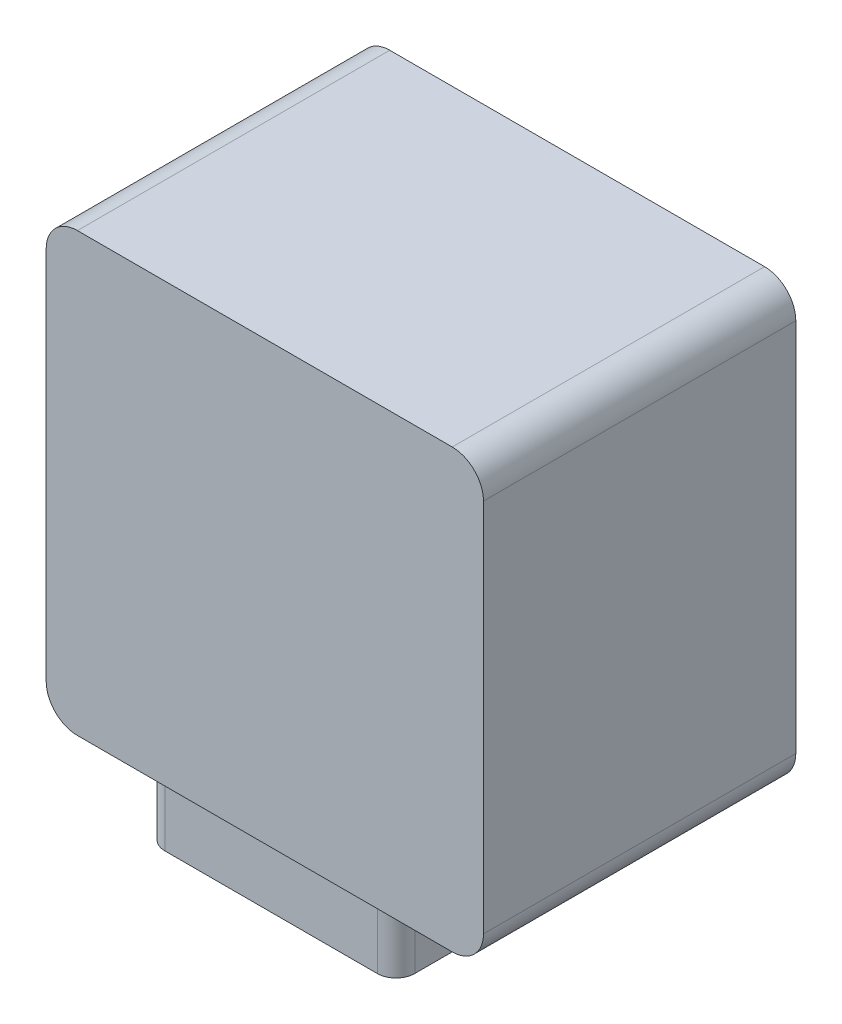
ISO-10303-21;
HEADER;
FILE_DESCRIPTION(('STEP AP214'),'2;1');
FILE_NAME('part.step','',(''),(''),'','','');
FILE_SCHEMA(('AUTOMOTIVE_DESIGN { 1 0 10303 214 1 1 1 1 }'));
ENDSEC;
DATA;
#1=APPLICATION_CONTEXT('core data for automotive mechanical design processes');
#2=APPLICATION_PROTOCOL_DEFINITION('international standard','automotive_design',2000,#1);
#3=PRODUCT_CONTEXT('',#1,'mechanical');
#4=PRODUCT('Part','Part','',(#3));
#5=PRODUCT_RELATED_PRODUCT_CATEGORY('part','',(#4));
#6=PRODUCT_DEFINITION_FORMATION('','',#4);
#7=PRODUCT_DEFINITION_CONTEXT('part definition',#1,'design');
#8=PRODUCT_DEFINITION('design','',#6,#7);
#9=PRODUCT_DEFINITION_SHAPE('','',#8);
#10=(LENGTH_UNIT() NAMED_UNIT(*) SI_UNIT(.MILLI.,.METRE.));
#11=(NAMED_UNIT(*) PLANE_ANGLE_UNIT() SI_UNIT($,.RADIAN.));
#12=(NAMED_UNIT(*) SI_UNIT($,.STERADIAN.) SOLID_ANGLE_UNIT());
#13=UNCERTAINTY_MEASURE_WITH_UNIT(LENGTH_MEASURE(1.E-05),#10,'distance_accuracy_value','');
#14=(GEOMETRIC_REPRESENTATION_CONTEXT(3) GLOBAL_UNCERTAINTY_ASSIGNED_CONTEXT((#13)) GLOBAL_UNIT_ASSIGNED_CONTEXT((#10,
#11,#12)) REPRESENTATION_CONTEXT('',''));
#15=CARTESIAN_POINT('',(0.,0.,0.));
#16=DIRECTION('',(0.,0.,1.));
#17=DIRECTION('',(1.,0.,0.));
#18=AXIS2_PLACEMENT_3D('',#15,#16,#17);
#19=CARTESIAN_POINT('',(11.8065425118772,61.2875658911726,50.));
#20=DIRECTION('',(0.,0.,-1.));
#21=DIRECTION('',(-1.,0.,0.));
#22=AXIS2_PLACEMENT_3D('',#19,#20,#21);
#23=CYLINDRICAL_SURFACE('',#22,5.);
#24=CARTESIAN_POINT('',(11.8065425118772,61.2875658911726,0.));
#25=DIRECTION('',(0.,0.,1.));
#26=DIRECTION('',(-1.,0.,0.));
#27=AXIS2_PLACEMENT_3D('',#24,#25,#26);
#28=CIRCLE('',#27,5.);
#29=CARTESIAN_POINT('',(16.8065425118772,61.2875658911726,0.));
#30=VERTEX_POINT('',#29);
#31=CARTESIAN_POINT('',(11.8065425118772,66.2875658911726,0.));
#32=VERTEX_POINT('',#31);
#33=EDGE_CURVE('E168',#30,#32,#28,.T.);
#34=ORIENTED_EDGE('',*,*,#33,.T.);
#35=DIRECTION('',(0.,0.,-1.));
#36=VECTOR('',#35,1.);
#37=CARTESIAN_POINT('',(11.8065425118772,66.2875658911726,50.));
#38=LINE('',#37,#36);
#39=CARTESIAN_POINT('',(11.8065425118772,66.2875658911726,50.));
#40=VERTEX_POINT('',#39);
#41=EDGE_CURVE('E11',#40,#32,#38,.T.);
#42=ORIENTED_EDGE('',*,*,#41,.F.);
#43=CARTESIAN_POINT('',(11.8065425118772,61.2875658911726,50.));
#44=DIRECTION('',(0.,0.,1.));
#45=DIRECTION('',(-1.,0.,0.));
#46=AXIS2_PLACEMENT_3D('',#43,#44,#45);
#47=CIRCLE('',#46,5.);
#48=CARTESIAN_POINT('',(16.8065425118772,61.2875658911726,50.));
#49=VERTEX_POINT('',#48);
#50=EDGE_CURVE('E177',#49,#40,#47,.T.);
#51=ORIENTED_EDGE('',*,*,#50,.F.);
#52=DIRECTION('',(0.,0.,-1.));
#53=VECTOR('',#52,1.);
#54=CARTESIAN_POINT('',(16.8065425118772,61.2875658911726,50.));
#55=LINE('',#54,#53);
#56=EDGE_CURVE('E194',#49,#30,#55,.T.);
#57=ORIENTED_EDGE('',*,*,#56,.T.);
#58=EDGE_LOOP('',(#34,#42,#51,#57));
#59=FACE_BOUND('',#58,.T.);
#60=ADVANCED_FACE('F34',(#59),#23,.T.);
#61=CARTESIAN_POINT('',(-48.1934574881227,66.2875658911726,50.));
#62=DIRECTION('',(0.,-1.,0.));
#63=DIRECTION('',(0.,0.,-1.));
#64=AXIS2_PLACEMENT_3D('',#61,#62,#63);
#65=PLANE('',#64);
#66=DIRECTION('',(-1.,0.,0.));
#67=VECTOR('',#66,1.);
#68=CARTESIAN_POINT('',(-48.1934574881227,66.2875658911726,0.));
#69=LINE('',#68,#67);
#70=CARTESIAN_POINT('',(-48.1934574881227,66.2875658911726,0.));
#71=VERTEX_POINT('',#70);
#72=EDGE_CURVE('E171',#32,#71,#69,.T.);
#73=ORIENTED_EDGE('',*,*,#72,.T.);
#74=DIRECTION('',(0.,0.,-1.));
#75=VECTOR('',#74,1.);
#76=CARTESIAN_POINT('',(-48.1934574881227,66.2875658911726,50.));
#77=LINE('',#76,#75);
#78=CARTESIAN_POINT('',(-48.1934574881227,66.2875658911726,50.));
#79=VERTEX_POINT('',#78);
#80=EDGE_CURVE('E41',#79,#71,#77,.T.);
#81=ORIENTED_EDGE('',*,*,#80,.F.);
#82=DIRECTION('',(-1.,0.,0.));
#83=VECTOR('',#82,1.);
#84=CARTESIAN_POINT('',(-48.1934574881227,66.2875658911726,50.));
#85=LINE('',#84,#83);
#86=EDGE_CURVE('E180',#40,#79,#85,.T.);
#87=ORIENTED_EDGE('',*,*,#86,.F.);
#88=ORIENTED_EDGE('',*,*,#41,.T.);
#89=EDGE_LOOP('',(#73,#81,#87,#88));
#90=FACE_BOUND('',#89,.T.);
#91=ADVANCED_FACE('F252',(#90),#65,.F.);
#92=CARTESIAN_POINT('',(-48.1934574881228,61.2875658911726,50.));
#93=DIRECTION('',(0.,0.,-1.));
#94=DIRECTION('',(-1.,0.,0.));
#95=AXIS2_PLACEMENT_3D('',#92,#93,#94);
#96=CYLINDRICAL_SURFACE('',#95,5.);
#97=CARTESIAN_POINT('',(-48.1934574881228,61.2875658911726,0.));
#98=DIRECTION('',(0.,0.,1.));
#99=DIRECTION('',(1.,0.,0.));
#100=AXIS2_PLACEMENT_3D('',#97,#98,#99);
#101=CIRCLE('',#100,5.);
#102=CARTESIAN_POINT('',(-53.1934574881228,61.2875658911726,0.));
#103=VERTEX_POINT('',#102);
#104=EDGE_CURVE('E197',#71,#103,#101,.T.);
#105=ORIENTED_EDGE('',*,*,#104,.T.);
#106=DIRECTION('',(0.,0.,-1.));
#107=VECTOR('',#106,1.);
#108=CARTESIAN_POINT('',(-53.1934574881228,61.2875658911726,50.));
#109=LINE('',#108,#107);
#110=CARTESIAN_POINT('',(-53.1934574881228,61.2875658911726,50.));
#111=VERTEX_POINT('',#110);
#112=EDGE_CURVE('E222',#111,#103,#109,.T.);
#113=ORIENTED_EDGE('',*,*,#112,.F.);
#114=CARTESIAN_POINT('',(-48.1934574881228,61.2875658911726,50.));
#115=DIRECTION('',(0.,0.,1.));
#116=DIRECTION('',(1.,0.,0.));
#117=AXIS2_PLACEMENT_3D('',#114,#115,#116);
#118=CIRCLE('',#117,5.);
#119=EDGE_CURVE('E183',#79,#111,#118,.T.);
#120=ORIENTED_EDGE('',*,*,#119,.F.);
#121=ORIENTED_EDGE('',*,*,#80,.T.);
#122=EDGE_LOOP('',(#105,#113,#120,#121));
#123=FACE_BOUND('',#122,.T.);
#124=ADVANCED_FACE('F229',(#123),#96,.T.);
#125=CARTESIAN_POINT('',(-53.1934574881228,61.2875658911726,50.));
#126=DIRECTION('',(1.,0.,0.));
#127=DIRECTION('',(0.,0.,-1.));
#128=AXIS2_PLACEMENT_3D('',#125,#126,#127);
#129=PLANE('',#128);
#130=DIRECTION('',(0.,-1.,0.));
#131=VECTOR('',#130,1.);
#132=CARTESIAN_POINT('',(-53.1934574881228,61.2875658911726,0.));
#133=LINE('',#132,#131);
#134=CARTESIAN_POINT('',(-53.1934574881228,1.28756589117266,0.));
#135=VERTEX_POINT('',#134);
#136=EDGE_CURVE('E199',#103,#135,#133,.T.);
#137=ORIENTED_EDGE('',*,*,#136,.T.);
#138=DIRECTION('',(0.,0.,-1.));
#139=VECTOR('',#138,1.);
#140=CARTESIAN_POINT('',(-53.1934574881228,1.28756589117266,50.));
#141=LINE('',#140,#139);
#142=CARTESIAN_POINT('',(-53.1934574881228,1.28756589117266,50.));
#143=VERTEX_POINT('',#142);
#144=EDGE_CURVE('E219',#143,#135,#141,.T.);
#145=ORIENTED_EDGE('',*,*,#144,.F.);
#146=DIRECTION('',(0.,-1.,0.));
#147=VECTOR('',#146,1.);
#148=CARTESIAN_POINT('',(-53.1934574881228,61.2875658911726,50.));
#149=LINE('',#148,#147);
#150=EDGE_CURVE('E185',#111,#143,#149,.T.);
#151=ORIENTED_EDGE('',*,*,#150,.F.);
#152=ORIENTED_EDGE('',*,*,#112,.T.);
#153=EDGE_LOOP('',(#137,#145,#151,#152));
#154=FACE_BOUND('',#153,.T.);
#155=ADVANCED_FACE('F240',(#154),#129,.F.);
#156=CARTESIAN_POINT('',(-48.1934574881228,1.28756589117263,50.));
#157=DIRECTION('',(0.,0.,-1.));
#158=DIRECTION('',(-1.,0.,0.));
#159=AXIS2_PLACEMENT_3D('',#156,#157,#158);
#160=CYLINDRICAL_SURFACE('',#159,5.);
#161=CARTESIAN_POINT('',(-48.1934574881228,1.28756589117263,0.));
#162=DIRECTION('',(0.,0.,1.));
#163=DIRECTION('',(1.,0.,0.));
#164=AXIS2_PLACEMENT_3D('',#161,#162,#163);
#165=CIRCLE('',#164,5.);
#166=CARTESIAN_POINT('',(-48.1934574881227,-3.71243410882737,0.));
#167=VERTEX_POINT('',#166);
#168=EDGE_CURVE('E201',#135,#167,#165,.T.);
#169=ORIENTED_EDGE('',*,*,#168,.T.);
#170=DIRECTION('',(0.,0.,-1.));
#171=VECTOR('',#170,1.);
#172=CARTESIAN_POINT('',(-48.1934574881227,-3.71243410882737,50.));
#173=LINE('',#172,#171);
#174=CARTESIAN_POINT('',(-48.1934574881227,-3.71243410882737,50.));
#175=VERTEX_POINT('',#174);
#176=EDGE_CURVE('E216',#175,#167,#173,.T.);
#177=ORIENTED_EDGE('',*,*,#176,.F.);
#178=CARTESIAN_POINT('',(-48.1934574881228,1.28756589117263,50.));
#179=DIRECTION('',(0.,0.,1.));
#180=DIRECTION('',(1.,0.,0.));
#181=AXIS2_PLACEMENT_3D('',#178,#179,#180);
#182=CIRCLE('',#181,5.);
#183=EDGE_CURVE('E187',#143,#175,#182,.T.);
#184=ORIENTED_EDGE('',*,*,#183,.F.);
#185=ORIENTED_EDGE('',*,*,#144,.T.);
#186=EDGE_LOOP('',(#169,#177,#184,#185));
#187=FACE_BOUND('',#186,.T.);
#188=ADVANCED_FACE('F244',(#187),#160,.T.);
#189=CARTESIAN_POINT('',(-48.1934574881227,-3.71243410882737,50.));
#190=DIRECTION('',(0.,1.,0.));
#191=DIRECTION('',(0.,0.,1.));
#192=AXIS2_PLACEMENT_3D('',#189,#190,#191);
#193=PLANE('',#192);
#194=CARTESIAN_POINT('',(-1.19345748812275,-3.71243410882737,12.));
#195=DIRECTION('',(0.,-1.,0.));
#196=DIRECTION('',(0.,0.,-1.));
#197=AXIS2_PLACEMENT_3D('',#194,#195,#196);
#198=CIRCLE('',#197,3.);
#199=CARTESIAN_POINT('',(-1.19345748812277,-3.71243410882737,9.));
#200=VERTEX_POINT('',#199);
#201=CARTESIAN_POINT('',(1.80654251187724,-3.71243410882737,12.));
#202=VERTEX_POINT('',#201);
#203=EDGE_CURVE('E510',#200,#202,#198,.T.);
#204=ORIENTED_EDGE('',*,*,#203,.F.);
#205=DIRECTION('',(1.,0.,0.));
#206=VECTOR('',#205,1.);
#207=CARTESIAN_POINT('',(-18.1934574881228,-3.71243410882737,9.));
#208=LINE('',#207,#206);
#209=CARTESIAN_POINT('',(-35.1934574881227,-3.71243410882737,9.));
#210=VERTEX_POINT('',#209);
#211=EDGE_CURVE('E164',#210,#200,#208,.T.);
#212=ORIENTED_EDGE('',*,*,#211,.F.);
#213=CARTESIAN_POINT('',(-35.1934574881227,-3.71243410882737,12.));
#214=DIRECTION('',(0.,-1.,0.));
#215=DIRECTION('',(0.,0.,1.));
#216=AXIS2_PLACEMENT_3D('',#213,#214,#215);
#217=CIRCLE('',#216,3.);
#218=CARTESIAN_POINT('',(-38.1934574881228,-3.71243410882737,12.));
#219=VERTEX_POINT('',#218);
#220=EDGE_CURVE('E536',#219,#210,#217,.T.);
#221=ORIENTED_EDGE('',*,*,#220,.F.);
#222=DIRECTION('',(0.,0.,-1.));
#223=VECTOR('',#222,1.);
#224=CARTESIAN_POINT('',(-38.1934574881228,-3.71243410882737,12.));
#225=LINE('',#224,#223);
#226=CARTESIAN_POINT('',(-38.1934574881228,-3.71243410882737,46.));
#227=VERTEX_POINT('',#226);
#228=EDGE_CURVE('E533',#227,#219,#225,.T.);
#229=ORIENTED_EDGE('',*,*,#228,.F.);
#230=CARTESIAN_POINT('',(-35.1934574881227,-3.71243410882737,46.));
#231=DIRECTION('',(0.,-1.,0.));
#232=DIRECTION('',(0.,0.,1.));
#233=AXIS2_PLACEMENT_3D('',#230,#231,#232);
#234=CIRCLE('',#233,3.);
#235=CARTESIAN_POINT('',(-35.1934574881227,-3.71243410882737,49.));
#236=VERTEX_POINT('',#235);
#237=EDGE_CURVE('E530',#236,#227,#234,.T.);
#238=ORIENTED_EDGE('',*,*,#237,.F.);
#239=DIRECTION('',(-1.,0.,0.));
#240=VECTOR('',#239,1.);
#241=CARTESIAN_POINT('',(-35.1934574881227,-3.71243410882737,49.));
#242=LINE('',#241,#240);
#243=CARTESIAN_POINT('',(-1.19345748812277,-3.71243410882737,49.));
#244=VERTEX_POINT('',#243);
#245=EDGE_CURVE('E527',#244,#236,#242,.T.);
#246=ORIENTED_EDGE('',*,*,#245,.F.);
#247=CARTESIAN_POINT('',(-1.19345748812275,-3.71243410882737,46.));
#248=DIRECTION('',(0.,-1.,0.));
#249=DIRECTION('',(0.,0.,1.));
#250=AXIS2_PLACEMENT_3D('',#247,#248,#249);
#251=CIRCLE('',#250,3.);
#252=CARTESIAN_POINT('',(1.80654251187725,-3.71243410882737,46.));
#253=VERTEX_POINT('',#252);
#254=EDGE_CURVE('E53',#253,#244,#251,.T.);
#255=ORIENTED_EDGE('',*,*,#254,.F.);
#256=DIRECTION('',(0.,0.,1.));
#257=VECTOR('',#256,1.);
#258=CARTESIAN_POINT('',(1.80654251187725,-3.71243410882737,46.));
#259=LINE('',#258,#257);
#260=EDGE_CURVE('E48',#202,#253,#259,.T.);
#261=ORIENTED_EDGE('',*,*,#260,.F.);
#262=EDGE_LOOP('',(#204,#212,#221,#229,#238,#246,#255,#261));
#263=FACE_BOUND('',#262,.T.);
#264=DIRECTION('',(1.,0.,0.));
#265=VECTOR('',#264,1.);
#266=CARTESIAN_POINT('',(-48.1934574881227,-3.71243410882737,0.));
#267=LINE('',#266,#265);
#268=CARTESIAN_POINT('',(11.8065425118772,-3.71243410882737,0.));
#269=VERTEX_POINT('',#268);
#270=EDGE_CURVE('E203',#167,#269,#267,.T.);
#271=ORIENTED_EDGE('',*,*,#270,.T.);
#272=DIRECTION('',(0.,0.,-1.));
#273=VECTOR('',#272,1.);
#274=CARTESIAN_POINT('',(11.8065425118772,-3.71243410882737,50.));
#275=LINE('',#274,#273);
#276=CARTESIAN_POINT('',(11.8065425118772,-3.71243410882737,50.));
#277=VERTEX_POINT('',#276);
#278=EDGE_CURVE('E213',#277,#269,#275,.T.);
#279=ORIENTED_EDGE('',*,*,#278,.F.);
#280=DIRECTION('',(1.,0.,0.));
#281=VECTOR('',#280,1.);
#282=CARTESIAN_POINT('',(-48.1934574881227,-3.71243410882737,50.));
#283=LINE('',#282,#281);
#284=EDGE_CURVE('E189',#175,#277,#283,.T.);
#285=ORIENTED_EDGE('',*,*,#284,.F.);
#286=ORIENTED_EDGE('',*,*,#176,.T.);
#287=EDGE_LOOP('',(#271,#279,#285,#286));
#288=FACE_BOUND('',#287,.T.);
#289=ADVANCED_FACE('F265',(#263,#288),#193,.F.);
#290=CARTESIAN_POINT('',(11.8065425118773,1.28756589117263,50.));
#291=DIRECTION('',(0.,0.,-1.));
#292=DIRECTION('',(-1.,0.,0.));
#293=AXIS2_PLACEMENT_3D('',#290,#291,#292);
#294=CYLINDRICAL_SURFACE('',#293,5.);
#295=CARTESIAN_POINT('',(11.8065425118773,1.28756589117263,0.));
#296=DIRECTION('',(0.,0.,1.));
#297=DIRECTION('',(1.,0.,0.));
#298=AXIS2_PLACEMENT_3D('',#295,#296,#297);
#299=CIRCLE('',#298,5.);
#300=CARTESIAN_POINT('',(16.8065425118773,1.28756589117263,0.));
#301=VERTEX_POINT('',#300);
#302=EDGE_CURVE('E205',#269,#301,#299,.T.);
#303=ORIENTED_EDGE('',*,*,#302,.T.);
#304=DIRECTION('',(0.,0.,-1.));
#305=VECTOR('',#304,1.);
#306=CARTESIAN_POINT('',(16.8065425118773,1.28756589117263,50.));
#307=LINE('',#306,#305);
#308=CARTESIAN_POINT('',(16.8065425118773,1.28756589117263,50.));
#309=VERTEX_POINT('',#308);
#310=EDGE_CURVE('E210',#309,#301,#307,.T.);
#311=ORIENTED_EDGE('',*,*,#310,.F.);
#312=CARTESIAN_POINT('',(11.8065425118773,1.28756589117263,50.));
#313=DIRECTION('',(0.,0.,1.));
#314=DIRECTION('',(1.,0.,0.));
#315=AXIS2_PLACEMENT_3D('',#312,#313,#314);
#316=CIRCLE('',#315,5.);
#317=EDGE_CURVE('E191',#277,#309,#316,.T.);
#318=ORIENTED_EDGE('',*,*,#317,.F.);
#319=ORIENTED_EDGE('',*,*,#278,.T.);
#320=EDGE_LOOP('',(#303,#311,#318,#319));
#321=FACE_BOUND('',#320,.T.);
#322=ADVANCED_FACE('F263',(#321),#294,.T.);
#323=CARTESIAN_POINT('',(16.8065425118772,61.2875658911726,50.));
#324=DIRECTION('',(-1.,0.,0.));
#325=DIRECTION('',(0.,-1.,0.));
#326=AXIS2_PLACEMENT_3D('',#323,#324,#325);
#327=PLANE('',#326);
#328=DIRECTION('',(0.,1.,0.));
#329=VECTOR('',#328,1.);
#330=CARTESIAN_POINT('',(16.8065425118772,61.2875658911726,0.));
#331=LINE('',#330,#329);
#332=EDGE_CURVE('E181',#301,#30,#331,.T.);
#333=ORIENTED_EDGE('',*,*,#332,.T.);
#334=ORIENTED_EDGE('',*,*,#56,.F.);
#335=DIRECTION('',(0.,1.,0.));
#336=VECTOR('',#335,1.);
#337=CARTESIAN_POINT('',(16.8065425118772,61.2875658911726,50.));
#338=LINE('',#337,#336);
#339=EDGE_CURVE('E193',#309,#49,#338,.T.);
#340=ORIENTED_EDGE('',*,*,#339,.F.);
#341=ORIENTED_EDGE('',*,*,#310,.T.);
#342=EDGE_LOOP('',(#333,#334,#340,#341));
#343=FACE_BOUND('',#342,.T.);
#344=ADVANCED_FACE('F258',(#343),#327,.F.);
#345=CARTESIAN_POINT('',(11.8065425118772,61.2875658911726,50.));
#346=DIRECTION('',(0.,0.,-1.));
#347=DIRECTION('',(-1.,0.,0.));
#348=AXIS2_PLACEMENT_3D('',#345,#346,#347);
#349=PLANE('',#348);
#350=ORIENTED_EDGE('',*,*,#50,.T.);
#351=ORIENTED_EDGE('',*,*,#86,.T.);
#352=ORIENTED_EDGE('',*,*,#119,.T.);
#353=ORIENTED_EDGE('',*,*,#150,.T.);
#354=ORIENTED_EDGE('',*,*,#183,.T.);
#355=ORIENTED_EDGE('',*,*,#284,.T.);
#356=ORIENTED_EDGE('',*,*,#317,.T.);
#357=ORIENTED_EDGE('',*,*,#339,.T.);
#358=EDGE_LOOP('',(#350,#351,#352,#353,#354,#355,#356,#357));
#359=FACE_BOUND('',#358,.T.);
#360=ADVANCED_FACE('F248',(#359),#349,.F.);
#361=CARTESIAN_POINT('',(11.8065425118772,61.2875658911726,0.));
#362=DIRECTION('',(0.,0.,-1.));
#363=DIRECTION('',(-1.,0.,0.));
#364=AXIS2_PLACEMENT_3D('',#361,#362,#363);
#365=PLANE('',#364);
#366=ORIENTED_EDGE('',*,*,#33,.F.);
#367=ORIENTED_EDGE('',*,*,#332,.F.);
#368=ORIENTED_EDGE('',*,*,#302,.F.);
#369=ORIENTED_EDGE('',*,*,#270,.F.);
#370=ORIENTED_EDGE('',*,*,#168,.F.);
#371=ORIENTED_EDGE('',*,*,#136,.F.);
#372=ORIENTED_EDGE('',*,*,#104,.F.);
#373=ORIENTED_EDGE('',*,*,#72,.F.);
#374=EDGE_LOOP('',(#366,#367,#368,#369,#370,#371,#372,#373));
#375=FACE_BOUND('',#374,.T.);
#376=ADVANCED_FACE('F235',(#375),#365,.T.);
#377=CARTESIAN_POINT('',(-1.19345748812275,-13.7124341088274,12.));
#378=DIRECTION('',(0.,-1.,0.));
#379=DIRECTION('',(0.,0.,-1.));
#380=AXIS2_PLACEMENT_3D('',#377,#378,#379);
#381=PLANE('',#380);
#382=CARTESIAN_POINT('',(-18.1934574881227,-13.7124341088274,16.5));
#383=DIRECTION('',(0.,-1.,0.));
#384=DIRECTION('',(0.,0.,-1.));
#385=AXIS2_PLACEMENT_3D('',#382,#383,#384);
#386=CIRCLE('',#385,3.);
#387=CARTESIAN_POINT('',(-18.1934574881227,-13.7124341088274,13.5));
#388=VERTEX_POINT('',#387);
#389=EDGE_CURVE('E497',#388,#388,#386,.T.);
#390=ORIENTED_EDGE('',*,*,#389,.F.);
#391=EDGE_LOOP('',(#390));
#392=FACE_BOUND('',#391,.T.);
#393=CARTESIAN_POINT('',(-18.1934574881227,-13.7124341088274,41.5));
#394=DIRECTION('',(0.,-1.,0.));
#395=DIRECTION('',(0.,0.,-1.));
#396=AXIS2_PLACEMENT_3D('',#393,#394,#395);
#397=CIRCLE('',#396,3.);
#398=CARTESIAN_POINT('',(-18.1934574881227,-13.7124341088274,38.5));
#399=VERTEX_POINT('',#398);
#400=EDGE_CURVE('E507',#399,#399,#397,.T.);
#401=ORIENTED_EDGE('',*,*,#400,.F.);
#402=EDGE_LOOP('',(#401));
#403=FACE_BOUND('',#402,.T.);
#404=DIRECTION('',(1.,0.,0.));
#405=VECTOR('',#404,1.);
#406=CARTESIAN_POINT('',(-18.1934574881228,-13.7124341088274,9.));
#407=LINE('',#406,#405);
#408=CARTESIAN_POINT('',(-35.1934574881227,-13.7124341088274,9.));
#409=VERTEX_POINT('',#408);
#410=CARTESIAN_POINT('',(-1.19345748812277,-13.7124341088274,9.));
#411=VERTEX_POINT('',#410);
#412=EDGE_CURVE('E154',#409,#411,#407,.T.);
#413=ORIENTED_EDGE('',*,*,#412,.T.);
#414=CARTESIAN_POINT('',(-1.19345748812275,-13.7124341088274,12.));
#415=DIRECTION('',(0.,-1.,0.));
#416=DIRECTION('',(0.,0.,-1.));
#417=AXIS2_PLACEMENT_3D('',#414,#415,#416);
#418=CIRCLE('',#417,3.);
#419=CARTESIAN_POINT('',(1.80654251187725,-13.7124341088274,12.));
#420=VERTEX_POINT('',#419);
#421=EDGE_CURVE('E144',#411,#420,#418,.T.);
#422=ORIENTED_EDGE('',*,*,#421,.T.);
#423=DIRECTION('',(0.,0.,1.));
#424=VECTOR('',#423,1.);
#425=CARTESIAN_POINT('',(1.80654251187725,-13.7124341088274,46.));
#426=LINE('',#425,#424);
#427=CARTESIAN_POINT('',(1.80654251187725,-13.7124341088274,46.));
#428=VERTEX_POINT('',#427);
#429=EDGE_CURVE('E153',#420,#428,#426,.T.);
#430=ORIENTED_EDGE('',*,*,#429,.T.);
#431=CARTESIAN_POINT('',(-1.19345748812275,-13.7124341088274,46.));
#432=DIRECTION('',(0.,-1.,0.));
#433=DIRECTION('',(0.,0.,1.));
#434=AXIS2_PLACEMENT_3D('',#431,#432,#433);
#435=CIRCLE('',#434,3.);
#436=CARTESIAN_POINT('',(-1.19345748812277,-13.7124341088274,49.));
#437=VERTEX_POINT('',#436);
#438=EDGE_CURVE('E514',#428,#437,#435,.T.);
#439=ORIENTED_EDGE('',*,*,#438,.T.);
#440=DIRECTION('',(-1.,0.,0.));
#441=VECTOR('',#440,1.);
#442=CARTESIAN_POINT('',(-35.1934574881227,-13.7124341088274,49.));
#443=LINE('',#442,#441);
#444=CARTESIAN_POINT('',(-35.1934574881227,-13.7124341088274,49.));
#445=VERTEX_POINT('',#444);
#446=EDGE_CURVE('E516',#437,#445,#443,.T.);
#447=ORIENTED_EDGE('',*,*,#446,.T.);
#448=CARTESIAN_POINT('',(-35.1934574881227,-13.7124341088274,46.));
#449=DIRECTION('',(0.,-1.,0.));
#450=DIRECTION('',(0.,0.,1.));
#451=AXIS2_PLACEMENT_3D('',#448,#449,#450);
#452=CIRCLE('',#451,3.);
#453=CARTESIAN_POINT('',(-38.1934574881228,-13.7124341088274,46.));
#454=VERTEX_POINT('',#453);
#455=EDGE_CURVE('E518',#445,#454,#452,.T.);
#456=ORIENTED_EDGE('',*,*,#455,.T.);
#457=DIRECTION('',(0.,0.,-1.));
#458=VECTOR('',#457,1.);
#459=CARTESIAN_POINT('',(-38.1934574881228,-13.7124341088274,12.));
#460=LINE('',#459,#458);
#461=CARTESIAN_POINT('',(-38.1934574881228,-13.7124341088274,12.));
#462=VERTEX_POINT('',#461);
#463=EDGE_CURVE('E520',#454,#462,#460,.T.);
#464=ORIENTED_EDGE('',*,*,#463,.T.);
#465=CARTESIAN_POINT('',(-35.1934574881227,-13.7124341088274,12.));
#466=DIRECTION('',(0.,-1.,0.));
#467=DIRECTION('',(0.,0.,1.));
#468=AXIS2_PLACEMENT_3D('',#465,#466,#467);
#469=CIRCLE('',#468,3.);
#470=EDGE_CURVE('E160',#462,#409,#469,.T.);
#471=ORIENTED_EDGE('',*,*,#470,.T.);
#472=EDGE_LOOP('',(#413,#422,#430,#439,#447,#456,#464,#471));
#473=FACE_BOUND('',#472,.T.);
#474=CARTESIAN_POINT('',(-30.6934574881227,-13.7124341088274,29.));
#475=DIRECTION('',(0.,-1.,0.));
#476=DIRECTION('',(0.,0.,-1.));
#477=AXIS2_PLACEMENT_3D('',#474,#475,#476);
#478=CIRCLE('',#477,3.);
#479=CARTESIAN_POINT('',(-30.6934574881227,-13.7124341088274,26.));
#480=VERTEX_POINT('',#479);
#481=EDGE_CURVE('E496',#480,#480,#478,.T.);
#482=ORIENTED_EDGE('',*,*,#481,.F.);
#483=EDGE_LOOP('',(#482));
#484=FACE_BOUND('',#483,.T.);
#485=CARTESIAN_POINT('',(-5.69345748812275,-13.7124341088274,29.));
#486=DIRECTION('',(0.,-1.,0.));
#487=DIRECTION('',(0.,0.,-1.));
#488=AXIS2_PLACEMENT_3D('',#485,#486,#487);
#489=CIRCLE('',#488,3.);
#490=CARTESIAN_POINT('',(-5.69345748812275,-13.7124341088274,26.));
#491=VERTEX_POINT('',#490);
#492=EDGE_CURVE('E567',#491,#491,#489,.T.);
#493=ORIENTED_EDGE('',*,*,#492,.F.);
#494=EDGE_LOOP('',(#493));
#495=FACE_BOUND('',#494,.T.);
#496=ADVANCED_FACE('F157',(#392,#403,#473,#484,#495),#381,.T.);
#497=CARTESIAN_POINT('',(-1.19345748812275,-13.7124341088274,12.));
#498=DIRECTION('',(0.,1.,0.));
#499=DIRECTION('',(0.,0.,1.));
#500=AXIS2_PLACEMENT_3D('',#497,#498,#499);
#501=CYLINDRICAL_SURFACE('',#500,3.);
#502=ORIENTED_EDGE('',*,*,#203,.T.);
#503=DIRECTION('',(0.,1.,0.));
#504=VECTOR('',#503,1.);
#505=CARTESIAN_POINT('',(1.80654251187725,-13.7124341088274,12.));
#506=LINE('',#505,#504);
#507=EDGE_CURVE('E150',#420,#202,#506,.T.);
#508=ORIENTED_EDGE('',*,*,#507,.F.);
#509=ORIENTED_EDGE('',*,*,#421,.F.);
#510=DIRECTION('',(0.,1.,0.));
#511=VECTOR('',#510,1.);
#512=CARTESIAN_POINT('',(-1.19345748812277,-13.7124341088274,9.));
#513=LINE('',#512,#511);
#514=EDGE_CURVE('E148',#411,#200,#513,.T.);
#515=ORIENTED_EDGE('',*,*,#514,.T.);
#516=EDGE_LOOP('',(#502,#508,#509,#515));
#517=FACE_BOUND('',#516,.T.);
#518=ADVANCED_FACE('F146',(#517),#501,.T.);
#519=CARTESIAN_POINT('',(1.80654251187725,-13.7124341088274,46.));
#520=DIRECTION('',(-1.,0.,0.));
#521=DIRECTION('',(0.,0.,1.));
#522=AXIS2_PLACEMENT_3D('',#519,#520,#521);
#523=PLANE('',#522);
#524=ORIENTED_EDGE('',*,*,#260,.T.);
#525=DIRECTION('',(0.,1.,0.));
#526=VECTOR('',#525,1.);
#527=CARTESIAN_POINT('',(1.80654251187725,-13.7124341088274,46.));
#528=LINE('',#527,#526);
#529=EDGE_CURVE('E173',#428,#253,#528,.T.);
#530=ORIENTED_EDGE('',*,*,#529,.F.);
#531=ORIENTED_EDGE('',*,*,#429,.F.);
#532=ORIENTED_EDGE('',*,*,#507,.T.);
#533=EDGE_LOOP('',(#524,#530,#531,#532));
#534=FACE_BOUND('',#533,.T.);
#535=ADVANCED_FACE('F354',(#534),#523,.F.);
#536=CARTESIAN_POINT('',(-1.19345748812275,-13.7124341088274,46.));
#537=DIRECTION('',(0.,1.,0.));
#538=DIRECTION('',(0.,0.,1.));
#539=AXIS2_PLACEMENT_3D('',#536,#537,#538);
#540=CYLINDRICAL_SURFACE('',#539,3.);
#541=ORIENTED_EDGE('',*,*,#254,.T.);
#542=DIRECTION('',(0.,1.,0.));
#543=VECTOR('',#542,1.);
#544=CARTESIAN_POINT('',(-1.19345748812277,-13.7124341088274,49.));
#545=LINE('',#544,#543);
#546=EDGE_CURVE('E550',#437,#244,#545,.T.);
#547=ORIENTED_EDGE('',*,*,#546,.F.);
#548=ORIENTED_EDGE('',*,*,#438,.F.);
#549=ORIENTED_EDGE('',*,*,#529,.T.);
#550=EDGE_LOOP('',(#541,#547,#548,#549));
#551=FACE_BOUND('',#550,.T.);
#552=ADVANCED_FACE('F363',(#551),#540,.T.);
#553=CARTESIAN_POINT('',(-35.1934574881227,-13.7124341088274,49.));
#554=DIRECTION('',(0.,0.,-1.));
#555=DIRECTION('',(-1.,0.,0.));
#556=AXIS2_PLACEMENT_3D('',#553,#554,#555);
#557=PLANE('',#556);
#558=ORIENTED_EDGE('',*,*,#245,.T.);
#559=DIRECTION('',(0.,1.,0.));
#560=VECTOR('',#559,1.);
#561=CARTESIAN_POINT('',(-35.1934574881227,-13.7124341088274,49.));
#562=LINE('',#561,#560);
#563=EDGE_CURVE('E547',#445,#236,#562,.T.);
#564=ORIENTED_EDGE('',*,*,#563,.F.);
#565=ORIENTED_EDGE('',*,*,#446,.F.);
#566=ORIENTED_EDGE('',*,*,#546,.T.);
#567=EDGE_LOOP('',(#558,#564,#565,#566));
#568=FACE_BOUND('',#567,.T.);
#569=ADVANCED_FACE('F373',(#568),#557,.F.);
#570=CARTESIAN_POINT('',(-35.1934574881227,-13.7124341088274,46.));
#571=DIRECTION('',(0.,1.,0.));
#572=DIRECTION('',(0.,0.,1.));
#573=AXIS2_PLACEMENT_3D('',#570,#571,#572);
#574=CYLINDRICAL_SURFACE('',#573,3.);
#575=ORIENTED_EDGE('',*,*,#237,.T.);
#576=DIRECTION('',(0.,1.,0.));
#577=VECTOR('',#576,1.);
#578=CARTESIAN_POINT('',(-38.1934574881228,-13.7124341088274,46.));
#579=LINE('',#578,#577);
#580=EDGE_CURVE('E544',#454,#227,#579,.T.);
#581=ORIENTED_EDGE('',*,*,#580,.F.);
#582=ORIENTED_EDGE('',*,*,#455,.F.);
#583=ORIENTED_EDGE('',*,*,#563,.T.);
#584=EDGE_LOOP('',(#575,#581,#582,#583));
#585=FACE_BOUND('',#584,.T.);
#586=ADVANCED_FACE('F383',(#585),#574,.T.);
#587=CARTESIAN_POINT('',(-38.1934574881228,-13.7124341088274,12.));
#588=DIRECTION('',(1.,0.,0.));
#589=DIRECTION('',(0.,0.,-1.));
#590=AXIS2_PLACEMENT_3D('',#587,#588,#589);
#591=PLANE('',#590);
#592=ORIENTED_EDGE('',*,*,#228,.T.);
#593=DIRECTION('',(0.,1.,0.));
#594=VECTOR('',#593,1.);
#595=CARTESIAN_POINT('',(-38.1934574881228,-13.7124341088274,12.));
#596=LINE('',#595,#594);
#597=EDGE_CURVE('E541',#462,#219,#596,.T.);
#598=ORIENTED_EDGE('',*,*,#597,.F.);
#599=ORIENTED_EDGE('',*,*,#463,.F.);
#600=ORIENTED_EDGE('',*,*,#580,.T.);
#601=EDGE_LOOP('',(#592,#598,#599,#600));
#602=FACE_BOUND('',#601,.T.);
#603=ADVANCED_FACE('F393',(#602),#591,.F.);
#604=CARTESIAN_POINT('',(-35.1934574881227,-13.7124341088274,12.));
#605=DIRECTION('',(0.,1.,0.));
#606=DIRECTION('',(0.,0.,1.));
#607=AXIS2_PLACEMENT_3D('',#604,#605,#606);
#608=CYLINDRICAL_SURFACE('',#607,3.);
#609=ORIENTED_EDGE('',*,*,#220,.T.);
#610=DIRECTION('',(0.,1.,0.));
#611=VECTOR('',#610,1.);
#612=CARTESIAN_POINT('',(-35.1934574881227,-13.7124341088274,9.));
#613=LINE('',#612,#611);
#614=EDGE_CURVE('E523',#409,#210,#613,.T.);
#615=ORIENTED_EDGE('',*,*,#614,.F.);
#616=ORIENTED_EDGE('',*,*,#470,.F.);
#617=ORIENTED_EDGE('',*,*,#597,.T.);
#618=EDGE_LOOP('',(#609,#615,#616,#617));
#619=FACE_BOUND('',#618,.T.);
#620=ADVANCED_FACE('F403',(#619),#608,.T.);
#621=CARTESIAN_POINT('',(-18.1934574881228,-13.7124341088274,9.));
#622=DIRECTION('',(0.,0.,1.));
#623=DIRECTION('',(1.,0.,0.));
#624=AXIS2_PLACEMENT_3D('',#621,#622,#623);
#625=PLANE('',#624);
#626=ORIENTED_EDGE('',*,*,#211,.T.);
#627=ORIENTED_EDGE('',*,*,#514,.F.);
#628=ORIENTED_EDGE('',*,*,#412,.F.);
#629=ORIENTED_EDGE('',*,*,#614,.T.);
#630=EDGE_LOOP('',(#626,#627,#628,#629));
#631=FACE_BOUND('',#630,.T.);
#632=ADVANCED_FACE('F167',(#631),#625,.F.);
#633=CARTESIAN_POINT('',(-18.1934574881227,-13.7124341088274,41.5));
#634=DIRECTION('',(0.,1.,0.));
#635=DIRECTION('',(0.,0.,1.));
#636=AXIS2_PLACEMENT_3D('',#633,#634,#635);
#637=CYLINDRICAL_SURFACE('',#636,3.);
#638=ORIENTED_EDGE('',*,*,#400,.T.);
#639=EDGE_LOOP('',(#638));
#640=FACE_BOUND('',#639,.T.);
#641=CARTESIAN_POINT('',(-18.1934574881227,-3.71243410882737,41.5));
#642=DIRECTION('',(0.,-1.,0.));
#643=DIRECTION('',(0.,0.,-1.));
#644=AXIS2_PLACEMENT_3D('',#641,#642,#643);
#645=CIRCLE('',#644,3.);
#646=CARTESIAN_POINT('',(-18.1934574881227,-3.71243410882737,38.5));
#647=VERTEX_POINT('',#646);
#648=EDGE_CURVE('E500',#647,#647,#645,.T.);
#649=ORIENTED_EDGE('',*,*,#648,.F.);
#650=EDGE_LOOP('',(#649));
#651=FACE_BOUND('',#650,.T.);
#652=ADVANCED_FACE('F423',(#640,#651),#637,.F.);
#653=CARTESIAN_POINT('',(-30.6934574881227,-13.7124341088274,29.));
#654=DIRECTION('',(0.,1.,0.));
#655=DIRECTION('',(0.,0.,1.));
#656=AXIS2_PLACEMENT_3D('',#653,#654,#655);
#657=CYLINDRICAL_SURFACE('',#656,3.);
#658=ORIENTED_EDGE('',*,*,#481,.T.);
#659=EDGE_LOOP('',(#658));
#660=FACE_BOUND('',#659,.T.);
#661=CARTESIAN_POINT('',(-30.6934574881227,-3.71243410882737,29.));
#662=DIRECTION('',(0.,-1.,0.));
#663=DIRECTION('',(0.,0.,-1.));
#664=AXIS2_PLACEMENT_3D('',#661,#662,#663);
#665=CIRCLE('',#664,3.);
#666=CARTESIAN_POINT('',(-30.6934574881227,-3.71243410882737,26.));
#667=VERTEX_POINT('',#666);
#668=EDGE_CURVE('E494',#667,#667,#665,.T.);
#669=ORIENTED_EDGE('',*,*,#668,.F.);
#670=EDGE_LOOP('',(#669));
#671=FACE_BOUND('',#670,.T.);
#672=ADVANCED_FACE('F432',(#660,#671),#657,.F.);
#673=CARTESIAN_POINT('',(-18.1934574881227,-13.7124341088274,16.5));
#674=DIRECTION('',(0.,1.,0.));
#675=DIRECTION('',(0.,0.,1.));
#676=AXIS2_PLACEMENT_3D('',#673,#674,#675);
#677=CYLINDRICAL_SURFACE('',#676,3.);
#678=ORIENTED_EDGE('',*,*,#389,.T.);
#679=EDGE_LOOP('',(#678));
#680=FACE_BOUND('',#679,.T.);
#681=CARTESIAN_POINT('',(-18.1934574881227,-3.71243410882737,16.5));
#682=DIRECTION('',(0.,-1.,0.));
#683=DIRECTION('',(0.,0.,-1.));
#684=AXIS2_PLACEMENT_3D('',#681,#682,#683);
#685=CIRCLE('',#684,3.);
#686=CARTESIAN_POINT('',(-18.1934574881227,-3.71243410882737,13.5));
#687=VERTEX_POINT('',#686);
#688=EDGE_CURVE('E503',#687,#687,#685,.T.);
#689=ORIENTED_EDGE('',*,*,#688,.F.);
#690=EDGE_LOOP('',(#689));
#691=FACE_BOUND('',#690,.T.);
#692=ADVANCED_FACE('F442',(#680,#691),#677,.F.);
#693=CARTESIAN_POINT('',(-5.69345748812275,-13.7124341088274,29.));
#694=DIRECTION('',(0.,1.,0.));
#695=DIRECTION('',(0.,0.,1.));
#696=AXIS2_PLACEMENT_3D('',#693,#694,#695);
#697=CYLINDRICAL_SURFACE('',#696,3.);
#698=ORIENTED_EDGE('',*,*,#492,.T.);
#699=EDGE_LOOP('',(#698));
#700=FACE_BOUND('',#699,.T.);
#701=CARTESIAN_POINT('',(-5.69345748812275,-3.71243410882737,29.));
#702=DIRECTION('',(0.,-1.,0.));
#703=DIRECTION('',(0.,0.,-1.));
#704=AXIS2_PLACEMENT_3D('',#701,#702,#703);
#705=CIRCLE('',#704,3.);
#706=CARTESIAN_POINT('',(-5.69345748812275,-3.71243410882737,26.));
#707=VERTEX_POINT('',#706);
#708=EDGE_CURVE('E569',#707,#707,#705,.T.);
#709=ORIENTED_EDGE('',*,*,#708,.F.);
#710=EDGE_LOOP('',(#709));
#711=FACE_BOUND('',#710,.T.);
#712=ADVANCED_FACE('F452',(#700,#711),#697,.F.);
#713=ORIENTED_EDGE('',*,*,#688,.T.);
#714=EDGE_LOOP('',(#713));
#715=FACE_BOUND('',#714,.T.);
#716=ADVANCED_FACE('F281',(#715),#193,.F.);
#717=ORIENTED_EDGE('',*,*,#668,.T.);
#718=EDGE_LOOP('',(#717));
#719=FACE_BOUND('',#718,.T.);
#720=ADVANCED_FACE('F277',(#719),#193,.F.);
#721=ORIENTED_EDGE('',*,*,#648,.T.);
#722=EDGE_LOOP('',(#721));
#723=FACE_BOUND('',#722,.T.);
#724=ADVANCED_FACE('F268',(#723),#193,.F.);
#725=ORIENTED_EDGE('',*,*,#708,.T.);
#726=EDGE_LOOP('',(#725));
#727=FACE_BOUND('',#726,.T.);
#728=ADVANCED_FACE('F269',(#727),#193,.F.);
#729=CLOSED_SHELL('',(#60,#91,#124,#155,#188,#289,#322,#344,#360,#376,#496,#518,#535,#552,#569,
#586,#603,#620,#632,#652,#672,#692,#712,#716,#720,#724,#728));
#730=MANIFOLD_SOLID_BREP('B2',#729);
#731=ADVANCED_BREP_SHAPE_REPRESENTATION('',(#18,#730),#14);
#732=SHAPE_DEFINITION_REPRESENTATION(#9,#731);
ENDSEC;
END-ISO-10303-21;
